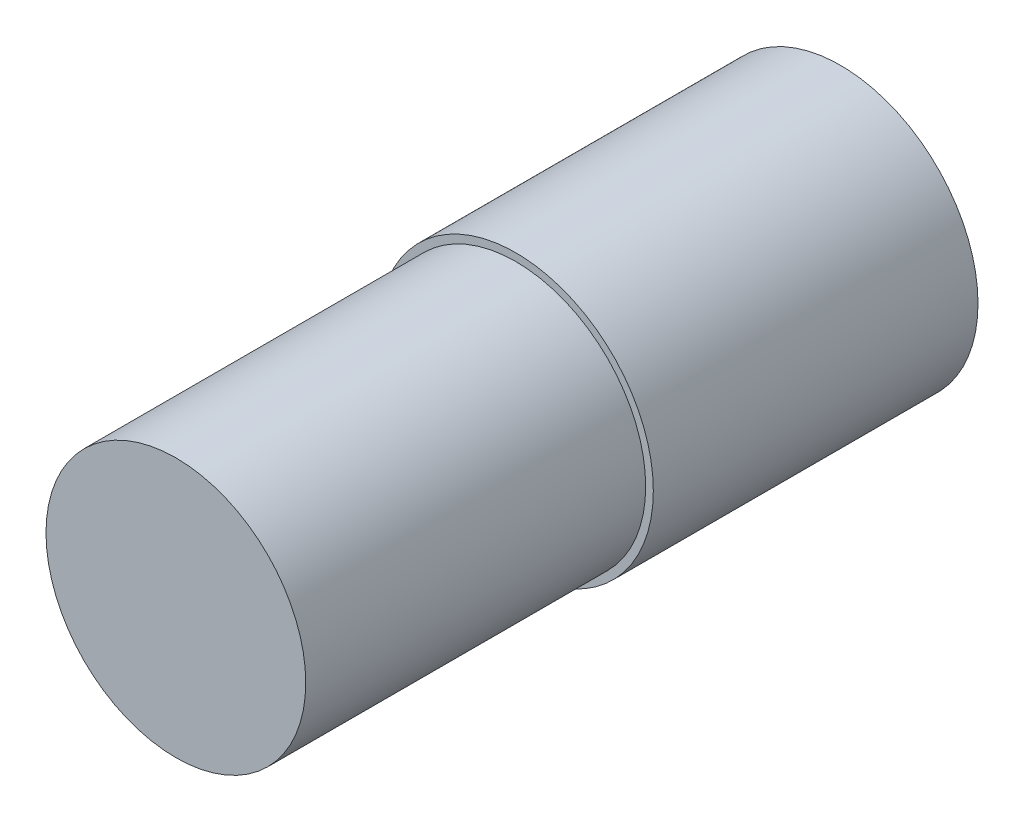
ISO-10303-21;
HEADER;
FILE_DESCRIPTION(('STEP AP214'),'2;1');
FILE_NAME('part.step','',(''),(''),'','','');
FILE_SCHEMA(('AUTOMOTIVE_DESIGN { 1 0 10303 214 1 1 1 1 }'));
ENDSEC;
DATA;
#1=APPLICATION_CONTEXT('core data for automotive mechanical design processes');
#2=APPLICATION_PROTOCOL_DEFINITION('international standard','automotive_design',2000,#1);
#3=PRODUCT_CONTEXT('',#1,'mechanical');
#4=PRODUCT('Part','Part','',(#3));
#5=PRODUCT_RELATED_PRODUCT_CATEGORY('part','',(#4));
#6=PRODUCT_DEFINITION_FORMATION('','',#4);
#7=PRODUCT_DEFINITION_CONTEXT('part definition',#1,'design');
#8=PRODUCT_DEFINITION('design','',#6,#7);
#9=PRODUCT_DEFINITION_SHAPE('','',#8);
#10=(LENGTH_UNIT() NAMED_UNIT(*) SI_UNIT(.MILLI.,.METRE.));
#11=(NAMED_UNIT(*) PLANE_ANGLE_UNIT() SI_UNIT($,.RADIAN.));
#12=(NAMED_UNIT(*) SI_UNIT($,.STERADIAN.) SOLID_ANGLE_UNIT());
#13=UNCERTAINTY_MEASURE_WITH_UNIT(LENGTH_MEASURE(1.E-05),#10,'distance_accuracy_value','');
#14=(GEOMETRIC_REPRESENTATION_CONTEXT(3) GLOBAL_UNCERTAINTY_ASSIGNED_CONTEXT((#13)) GLOBAL_UNIT_ASSIGNED_CONTEXT((#10,
#11,#12)) REPRESENTATION_CONTEXT('',''));
#15=CARTESIAN_POINT('',(0.,0.,0.));
#16=DIRECTION('',(0.,0.,1.));
#17=DIRECTION('',(1.,0.,0.));
#18=AXIS2_PLACEMENT_3D('',#15,#16,#17);
#19=CARTESIAN_POINT('',(0.,0.,42.5));
#20=DIRECTION('',(0.,0.,-1.));
#21=DIRECTION('',(-1.,0.,0.));
#22=AXIS2_PLACEMENT_3D('',#19,#20,#21);
#23=CYLINDRICAL_SURFACE('',#22,18.);
#24=CARTESIAN_POINT('',(0.,0.,42.5));
#25=DIRECTION('',(0.,0.,1.));
#26=DIRECTION('',(1.,0.,0.));
#27=AXIS2_PLACEMENT_3D('',#24,#25,#26);
#28=CIRCLE('',#27,18.);
#29=CARTESIAN_POINT('',(18.,0.,42.5));
#30=VERTEX_POINT('',#29);
#31=EDGE_CURVE('E55',#30,#30,#28,.T.);
#32=ORIENTED_EDGE('',*,*,#31,.F.);
#33=EDGE_LOOP('',(#32));
#34=FACE_BOUND('',#33,.T.);
#35=CARTESIAN_POINT('',(0.,0.,0.));
#36=DIRECTION('',(0.,0.,1.));
#37=DIRECTION('',(1.,0.,0.));
#38=AXIS2_PLACEMENT_3D('',#35,#36,#37);
#39=CIRCLE('',#38,18.);
#40=CARTESIAN_POINT('',(18.,0.,0.));
#41=VERTEX_POINT('',#40);
#42=EDGE_CURVE('E46',#41,#41,#39,.T.);
#43=ORIENTED_EDGE('',*,*,#42,.T.);
#44=EDGE_LOOP('',(#43));
#45=FACE_BOUND('',#44,.T.);
#46=ADVANCED_FACE('F43',(#34,#45),#23,.T.);
#47=CARTESIAN_POINT('',(0.,0.,42.5));
#48=DIRECTION('',(0.,0.,1.));
#49=DIRECTION('',(1.,0.,0.));
#50=AXIS2_PLACEMENT_3D('',#47,#48,#49);
#51=PLANE('',#50);
#52=CARTESIAN_POINT('',(0.,0.,42.5));
#53=DIRECTION('',(0.,0.,1.));
#54=DIRECTION('',(1.,0.,0.));
#55=AXIS2_PLACEMENT_3D('',#52,#53,#54);
#56=CIRCLE('',#55,17.);
#57=CARTESIAN_POINT('',(17.,0.,42.5));
#58=VERTEX_POINT('',#57);
#59=EDGE_CURVE('E50',#58,#58,#56,.T.);
#60=ORIENTED_EDGE('',*,*,#59,.F.);
#61=EDGE_LOOP('',(#60));
#62=FACE_BOUND('',#61,.T.);
#63=ORIENTED_EDGE('',*,*,#31,.T.);
#64=EDGE_LOOP('',(#63));
#65=FACE_BOUND('',#64,.T.);
#66=ADVANCED_FACE('F73',(#62,#65),#51,.T.);
#67=CARTESIAN_POINT('',(0.,0.,0.));
#68=DIRECTION('',(0.,0.,1.));
#69=DIRECTION('',(1.,0.,0.));
#70=AXIS2_PLACEMENT_3D('',#67,#68,#69);
#71=PLANE('',#70);
#72=CARTESIAN_POINT('',(0.,14.,0.));
#73=DIRECTION('',(0.,0.,-1.));
#74=DIRECTION('',(-1.,0.,0.));
#75=AXIS2_PLACEMENT_3D('',#72,#73,#74);
#76=CIRCLE('',#75,1.5);
#77=CARTESIAN_POINT('',(-1.5,14.,0.));
#78=VERTEX_POINT('',#77);
#79=EDGE_CURVE('E213',#78,#78,#76,.T.);
#80=ORIENTED_EDGE('',*,*,#79,.F.);
#81=EDGE_LOOP('',(#80));
#82=FACE_BOUND('',#81,.T.);
#83=CARTESIAN_POINT('',(-14.,-6.42628012313338E-13,0.));
#84=DIRECTION('',(0.,0.,-1.));
#85=DIRECTION('',(-1.,0.,0.));
#86=AXIS2_PLACEMENT_3D('',#83,#84,#85);
#87=CIRCLE('',#86,1.49999999999943);
#88=CARTESIAN_POINT('',(-15.4999999999994,-6.42628012313338E-13,0.));
#89=VERTEX_POINT('',#88);
#90=EDGE_CURVE('E217',#89,#89,#87,.T.);
#91=ORIENTED_EDGE('',*,*,#90,.F.);
#92=EDGE_LOOP('',(#91));
#93=FACE_BOUND('',#92,.T.);
#94=CARTESIAN_POINT('',(1.28525602462668E-12,-14.,0.));
#95=DIRECTION('',(0.,0.,-1.));
#96=DIRECTION('',(-1.,0.,0.));
#97=AXIS2_PLACEMENT_3D('',#94,#95,#96);
#98=CIRCLE('',#97,1.49999999999886);
#99=CARTESIAN_POINT('',(-1.49999999999758,-14.,0.));
#100=VERTEX_POINT('',#99);
#101=EDGE_CURVE('E225',#100,#100,#98,.T.);
#102=ORIENTED_EDGE('',*,*,#101,.F.);
#103=EDGE_LOOP('',(#102));
#104=FACE_BOUND('',#103,.T.);
#105=CARTESIAN_POINT('',(14.,1.92477541247106E-12,0.));
#106=DIRECTION('',(0.,0.,-1.));
#107=DIRECTION('',(-1.,0.,0.));
#108=AXIS2_PLACEMENT_3D('',#105,#106,#107);
#109=CIRCLE('',#108,1.4999999999983);
#110=CARTESIAN_POINT('',(12.5000000000017,1.92477541247106E-12,0.));
#111=VERTEX_POINT('',#110);
#112=EDGE_CURVE('E231',#111,#111,#109,.T.);
#113=ORIENTED_EDGE('',*,*,#112,.F.);
#114=EDGE_LOOP('',(#113));
#115=FACE_BOUND('',#114,.T.);
#116=CARTESIAN_POINT('',(0.,0.,0.));
#117=DIRECTION('',(0.,0.,-1.));
#118=DIRECTION('',(-1.,0.,0.));
#119=AXIS2_PLACEMENT_3D('',#116,#117,#118);
#120=CIRCLE('',#119,11.);
#121=CARTESIAN_POINT('',(-11.,0.,0.));
#122=VERTEX_POINT('',#121);
#123=EDGE_CURVE('E10',#122,#122,#120,.T.);
#124=ORIENTED_EDGE('',*,*,#123,.F.);
#125=EDGE_LOOP('',(#124));
#126=FACE_BOUND('',#125,.T.);
#127=ORIENTED_EDGE('',*,*,#42,.F.);
#128=EDGE_LOOP('',(#127));
#129=FACE_BOUND('',#128,.T.);
#130=ADVANCED_FACE('F70',(#82,#93,#104,#115,#126,#129),#71,.F.);
#131=CARTESIAN_POINT('',(0.,0.,87.));
#132=DIRECTION('',(0.,0.,-1.));
#133=DIRECTION('',(-1.,0.,0.));
#134=AXIS2_PLACEMENT_3D('',#131,#132,#133);
#135=CYLINDRICAL_SURFACE('',#134,17.);
#136=CARTESIAN_POINT('',(0.,0.,87.));
#137=DIRECTION('',(0.,0.,1.));
#138=DIRECTION('',(1.,0.,0.));
#139=AXIS2_PLACEMENT_3D('',#136,#137,#138);
#140=CIRCLE('',#139,17.);
#141=CARTESIAN_POINT('',(17.,0.,87.));
#142=VERTEX_POINT('',#141);
#143=EDGE_CURVE('E61',#142,#142,#140,.T.);
#144=ORIENTED_EDGE('',*,*,#143,.F.);
#145=EDGE_LOOP('',(#144));
#146=FACE_BOUND('',#145,.T.);
#147=ORIENTED_EDGE('',*,*,#59,.T.);
#148=EDGE_LOOP('',(#147));
#149=FACE_BOUND('',#148,.T.);
#150=ADVANCED_FACE('F72',(#146,#149),#135,.T.);
#151=CARTESIAN_POINT('',(0.,0.,87.));
#152=DIRECTION('',(0.,0.,1.));
#153=DIRECTION('',(1.,0.,0.));
#154=AXIS2_PLACEMENT_3D('',#151,#152,#153);
#155=PLANE('',#154);
#156=ORIENTED_EDGE('',*,*,#143,.T.);
#157=EDGE_LOOP('',(#156));
#158=FACE_BOUND('',#157,.T.);
#159=ADVANCED_FACE('F80',(#158),#155,.T.);
#160=CARTESIAN_POINT('',(0.,0.,-2.));
#161=DIRECTION('',(0.,0.,1.));
#162=DIRECTION('',(1.,0.,0.));
#163=AXIS2_PLACEMENT_3D('',#160,#161,#162);
#164=CYLINDRICAL_SURFACE('',#163,11.);
#165=CARTESIAN_POINT('',(0.,0.,-2.));
#166=DIRECTION('',(0.,0.,-1.));
#167=DIRECTION('',(-1.,0.,0.));
#168=AXIS2_PLACEMENT_3D('',#165,#166,#167);
#169=CIRCLE('',#168,11.);
#170=CARTESIAN_POINT('',(-11.,0.,-2.));
#171=VERTEX_POINT('',#170);
#172=EDGE_CURVE('E59',#171,#171,#169,.T.);
#173=ORIENTED_EDGE('',*,*,#172,.F.);
#174=EDGE_LOOP('',(#173));
#175=FACE_BOUND('',#174,.T.);
#176=ORIENTED_EDGE('',*,*,#123,.T.);
#177=EDGE_LOOP('',(#176));
#178=FACE_BOUND('',#177,.T.);
#179=ADVANCED_FACE('F109',(#175,#178),#164,.T.);
#180=CARTESIAN_POINT('',(0.,0.,-2.));
#181=DIRECTION('',(0.,0.,-1.));
#182=DIRECTION('',(-1.,0.,0.));
#183=AXIS2_PLACEMENT_3D('',#180,#181,#182);
#184=PLANE('',#183);
#185=ORIENTED_EDGE('',*,*,#172,.T.);
#186=EDGE_LOOP('',(#185));
#187=FACE_BOUND('',#186,.T.);
#188=ADVANCED_FACE('F117',(#187),#184,.T.);
#189=CARTESIAN_POINT('',(14.,1.92477541247106E-12,5.));
#190=DIRECTION('',(0.,0.,-1.));
#191=DIRECTION('',(-1.,0.,0.));
#192=AXIS2_PLACEMENT_3D('',#189,#190,#191);
#193=CYLINDRICAL_SURFACE('',#192,1.4999999999983);
#194=CARTESIAN_POINT('',(14.,1.92477541247106E-12,5.));
#195=DIRECTION('',(0.,0.,-1.));
#196=DIRECTION('',(-1.,0.,0.));
#197=AXIS2_PLACEMENT_3D('',#194,#195,#196);
#198=CIRCLE('',#197,1.4999999999983);
#199=CARTESIAN_POINT('',(12.5000000000017,1.92477541247106E-12,5.));
#200=VERTEX_POINT('',#199);
#201=EDGE_CURVE('E233',#200,#200,#198,.T.);
#202=ORIENTED_EDGE('',*,*,#201,.F.);
#203=EDGE_LOOP('',(#202));
#204=FACE_BOUND('',#203,.T.);
#205=ORIENTED_EDGE('',*,*,#112,.T.);
#206=EDGE_LOOP('',(#205));
#207=FACE_BOUND('',#206,.T.);
#208=ADVANCED_FACE('F125',(#204,#207),#193,.F.);
#209=CARTESIAN_POINT('',(14.,1.92477541247106E-12,5.));
#210=DIRECTION('',(0.,0.,-1.));
#211=DIRECTION('',(-1.,0.,0.));
#212=AXIS2_PLACEMENT_3D('',#209,#210,#211);
#213=PLANE('',#212);
#214=ORIENTED_EDGE('',*,*,#201,.T.);
#215=EDGE_LOOP('',(#214));
#216=FACE_BOUND('',#215,.T.);
#217=ADVANCED_FACE('F137',(#216),#213,.T.);
#218=CARTESIAN_POINT('',(1.28525602462668E-12,-14.,5.));
#219=DIRECTION('',(0.,0.,-1.));
#220=DIRECTION('',(-1.,0.,0.));
#221=AXIS2_PLACEMENT_3D('',#218,#219,#220);
#222=CYLINDRICAL_SURFACE('',#221,1.49999999999886);
#223=CARTESIAN_POINT('',(1.28525602462668E-12,-14.,5.));
#224=DIRECTION('',(0.,0.,-1.));
#225=DIRECTION('',(-1.,0.,0.));
#226=AXIS2_PLACEMENT_3D('',#223,#224,#225);
#227=CIRCLE('',#226,1.49999999999886);
#228=CARTESIAN_POINT('',(-1.49999999999758,-14.,5.));
#229=VERTEX_POINT('',#228);
#230=EDGE_CURVE('E228',#229,#229,#227,.T.);
#231=ORIENTED_EDGE('',*,*,#230,.F.);
#232=EDGE_LOOP('',(#231));
#233=FACE_BOUND('',#232,.T.);
#234=ORIENTED_EDGE('',*,*,#101,.T.);
#235=EDGE_LOOP('',(#234));
#236=FACE_BOUND('',#235,.T.);
#237=ADVANCED_FACE('F147',(#233,#236),#222,.F.);
#238=CARTESIAN_POINT('',(1.28525602462668E-12,-14.,5.));
#239=DIRECTION('',(0.,0.,-1.));
#240=DIRECTION('',(-1.,0.,0.));
#241=AXIS2_PLACEMENT_3D('',#238,#239,#240);
#242=PLANE('',#241);
#243=ORIENTED_EDGE('',*,*,#230,.T.);
#244=EDGE_LOOP('',(#243));
#245=FACE_BOUND('',#244,.T.);
#246=ADVANCED_FACE('F157',(#245),#242,.T.);
#247=CARTESIAN_POINT('',(-14.,-6.42628012313338E-13,5.));
#248=DIRECTION('',(0.,0.,-1.));
#249=DIRECTION('',(-1.,0.,0.));
#250=AXIS2_PLACEMENT_3D('',#247,#248,#249);
#251=CYLINDRICAL_SURFACE('',#250,1.49999999999943);
#252=CARTESIAN_POINT('',(-14.,-6.42628012313338E-13,5.));
#253=DIRECTION('',(0.,0.,-1.));
#254=DIRECTION('',(-1.,0.,0.));
#255=AXIS2_PLACEMENT_3D('',#252,#253,#254);
#256=CIRCLE('',#255,1.49999999999943);
#257=CARTESIAN_POINT('',(-15.4999999999994,-6.42628012313338E-13,5.));
#258=VERTEX_POINT('',#257);
#259=EDGE_CURVE('E222',#258,#258,#256,.T.);
#260=ORIENTED_EDGE('',*,*,#259,.F.);
#261=EDGE_LOOP('',(#260));
#262=FACE_BOUND('',#261,.T.);
#263=ORIENTED_EDGE('',*,*,#90,.T.);
#264=EDGE_LOOP('',(#263));
#265=FACE_BOUND('',#264,.T.);
#266=ADVANCED_FACE('F167',(#262,#265),#251,.F.);
#267=CARTESIAN_POINT('',(-14.,-6.42628012313338E-13,5.));
#268=DIRECTION('',(0.,0.,-1.));
#269=DIRECTION('',(-1.,0.,0.));
#270=AXIS2_PLACEMENT_3D('',#267,#268,#269);
#271=PLANE('',#270);
#272=ORIENTED_EDGE('',*,*,#259,.T.);
#273=EDGE_LOOP('',(#272));
#274=FACE_BOUND('',#273,.T.);
#275=ADVANCED_FACE('F177',(#274),#271,.T.);
#276=CARTESIAN_POINT('',(0.,14.,5.));
#277=DIRECTION('',(0.,0.,-1.));
#278=DIRECTION('',(-1.,0.,0.));
#279=AXIS2_PLACEMENT_3D('',#276,#277,#278);
#280=CYLINDRICAL_SURFACE('',#279,1.5);
#281=CARTESIAN_POINT('',(0.,14.,5.));
#282=DIRECTION('',(0.,0.,-1.));
#283=DIRECTION('',(-1.,0.,0.));
#284=AXIS2_PLACEMENT_3D('',#281,#282,#283);
#285=CIRCLE('',#284,1.5);
#286=CARTESIAN_POINT('',(-1.5,14.,5.));
#287=VERTEX_POINT('',#286);
#288=EDGE_CURVE('E212',#287,#287,#285,.T.);
#289=ORIENTED_EDGE('',*,*,#288,.F.);
#290=EDGE_LOOP('',(#289));
#291=FACE_BOUND('',#290,.T.);
#292=ORIENTED_EDGE('',*,*,#79,.T.);
#293=EDGE_LOOP('',(#292));
#294=FACE_BOUND('',#293,.T.);
#295=ADVANCED_FACE('F187',(#291,#294),#280,.F.);
#296=CARTESIAN_POINT('',(0.,14.,5.));
#297=DIRECTION('',(0.,0.,-1.));
#298=DIRECTION('',(-1.,0.,0.));
#299=AXIS2_PLACEMENT_3D('',#296,#297,#298);
#300=PLANE('',#299);
#301=ORIENTED_EDGE('',*,*,#288,.T.);
#302=EDGE_LOOP('',(#301));
#303=FACE_BOUND('',#302,.T.);
#304=ADVANCED_FACE('F197',(#303),#300,.T.);
#305=CLOSED_SHELL('',(#46,#66,#130,#150,#159,#179,#188,#208,#217,#237,#246,#266,#275,#295,#304));
#306=MANIFOLD_SOLID_BREP('B2',#305);
#307=ADVANCED_BREP_SHAPE_REPRESENTATION('',(#18,#306),#14);
#308=SHAPE_DEFINITION_REPRESENTATION(#9,#307);
ENDSEC;
END-ISO-10303-21;
